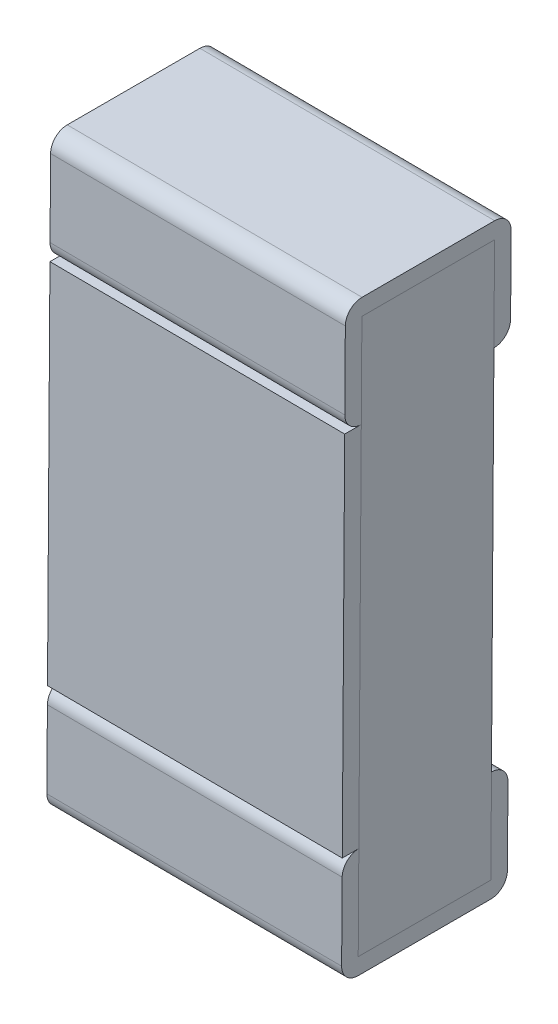
ISO-10303-21;
HEADER;
FILE_DESCRIPTION(('STEP AP214'),'2;1');
FILE_NAME('part.step','',(''),(''),'','','');
FILE_SCHEMA(('AUTOMOTIVE_DESIGN { 1 0 10303 214 1 1 1 1 }'));
ENDSEC;
DATA;
#1=APPLICATION_CONTEXT('core data for automotive mechanical design processes');
#2=APPLICATION_PROTOCOL_DEFINITION('international standard','automotive_design',2000,#1);
#3=PRODUCT_CONTEXT('',#1,'mechanical');
#4=PRODUCT('Part','Part','',(#3));
#5=PRODUCT_RELATED_PRODUCT_CATEGORY('part','',(#4));
#6=PRODUCT_DEFINITION_FORMATION('','',#4);
#7=PRODUCT_DEFINITION_CONTEXT('part definition',#1,'design');
#8=PRODUCT_DEFINITION('design','',#6,#7);
#9=PRODUCT_DEFINITION_SHAPE('','',#8);
#10=(LENGTH_UNIT() NAMED_UNIT(*) SI_UNIT(.MILLI.,.METRE.));
#11=(NAMED_UNIT(*) PLANE_ANGLE_UNIT() SI_UNIT($,.RADIAN.));
#12=(NAMED_UNIT(*) SI_UNIT($,.STERADIAN.) SOLID_ANGLE_UNIT());
#13=UNCERTAINTY_MEASURE_WITH_UNIT(LENGTH_MEASURE(1.E-05),#10,'distance_accuracy_value','');
#14=(GEOMETRIC_REPRESENTATION_CONTEXT(3) GLOBAL_UNCERTAINTY_ASSIGNED_CONTEXT((#13)) GLOBAL_UNIT_ASSIGNED_CONTEXT((#10,
#11,#12)) REPRESENTATION_CONTEXT('',''));
#15=CARTESIAN_POINT('',(0.,0.,0.));
#16=DIRECTION('',(0.,0.,1.));
#17=DIRECTION('',(1.,0.,0.));
#18=AXIS2_PLACEMENT_3D('',#15,#16,#17);
#19=CARTESIAN_POINT('',(214.437616581367,106.274761831493,142.661582908599));
#20=DIRECTION('',(0.,0.,1.));
#21=DIRECTION('',(1.,0.,0.));
#22=AXIS2_PLACEMENT_3D('',#19,#20,#21);
#23=PLANE('',#22);
#24=DIRECTION('',(0.999978016708569,-0.00663069374923689,0.));
#25=VECTOR('',#24,1.);
#26=CARTESIAN_POINT('',(214.437616581367,106.274761831493,142.661582908599));
#27=LINE('',#26,#25);
#28=CARTESIAN_POINT('',(214.437616581367,106.274761831493,142.661582908599));
#29=VERTEX_POINT('',#28);
#30=CARTESIAN_POINT('',(215.237598994734,106.269457276494,142.661582908599));
#31=VERTEX_POINT('',#30);
#32=EDGE_CURVE('E67',#29,#31,#27,.T.);
#33=ORIENTED_EDGE('',*,*,#32,.F.);
#34=DIRECTION('',(-0.00663069374923689,-0.999978016708569,0.));
#35=VECTOR('',#34,1.);
#36=CARTESIAN_POINT('',(214.437616581367,106.274761831493,142.661582908599));
#37=LINE('',#36,#35);
#38=CARTESIAN_POINT('',(214.430985887618,105.274783814784,142.661582908599));
#39=VERTEX_POINT('',#38);
#40=EDGE_CURVE('E11',#29,#39,#37,.T.);
#41=ORIENTED_EDGE('',*,*,#40,.T.);
#42=DIRECTION('',(0.999978016708569,-0.00663069374923689,0.));
#43=VECTOR('',#42,1.);
#44=CARTESIAN_POINT('',(214.430985887618,105.274783814784,142.661582908599));
#45=LINE('',#44,#43);
#46=CARTESIAN_POINT('',(215.230968300984,105.269479259785,142.661582908599));
#47=VERTEX_POINT('',#46);
#48=EDGE_CURVE('E55',#39,#47,#45,.T.);
#49=ORIENTED_EDGE('',*,*,#48,.T.);
#50=DIRECTION('',(-0.00663069374923689,-0.999978016708569,0.));
#51=VECTOR('',#50,1.);
#52=CARTESIAN_POINT('',(215.237598994734,106.269457276494,142.661582908599));
#53=LINE('',#52,#51);
#54=EDGE_CURVE('E345',#31,#47,#53,.T.);
#55=ORIENTED_EDGE('',*,*,#54,.F.);
#56=EDGE_LOOP('',(#33,#41,#49,#55));
#57=FACE_BOUND('',#56,.T.);
#58=ADVANCED_FACE('F44',(#57),#23,.T.);
#59=CARTESIAN_POINT('',(214.430985887618,105.274783814784,142.616582908599));
#60=DIRECTION('',(-0.00663069374923689,-0.99997801670857,0.));
#61=DIRECTION('',(-0.99997801670857,0.00663069374923689,0.));
#62=AXIS2_PLACEMENT_3D('',#59,#60,#61);
#63=PLANE('',#62);
#64=DIRECTION('',(0.,0.,1.));
#65=VECTOR('',#64,1.);
#66=CARTESIAN_POINT('',(214.430985887618,105.274783814784,142.616582908599));
#67=LINE('',#66,#65);
#68=CARTESIAN_POINT('',(214.430985887618,105.274783814784,142.616582908599));
#69=VERTEX_POINT('',#68);
#70=EDGE_CURVE('E377',#69,#39,#67,.T.);
#71=ORIENTED_EDGE('',*,*,#70,.F.);
#72=DIRECTION('',(0.999978016708569,-0.00663069374923689,0.));
#73=VECTOR('',#72,1.);
#74=CARTESIAN_POINT('',(214.430985887618,105.274783814784,142.616582908599));
#75=LINE('',#74,#73);
#76=CARTESIAN_POINT('',(215.230968300984,105.269479259785,142.616582908599));
#77=VERTEX_POINT('',#76);
#78=EDGE_CURVE('E311',#69,#77,#75,.T.);
#79=ORIENTED_EDGE('',*,*,#78,.T.);
#80=DIRECTION('',(0.,0.,1.));
#81=VECTOR('',#80,1.);
#82=CARTESIAN_POINT('',(215.230968300984,105.269479259785,142.616582908599));
#83=LINE('',#82,#81);
#84=EDGE_CURVE('E324',#77,#47,#83,.T.);
#85=ORIENTED_EDGE('',*,*,#84,.T.);
#86=ORIENTED_EDGE('',*,*,#48,.F.);
#87=EDGE_LOOP('',(#71,#79,#85,#86));
#88=FACE_BOUND('',#87,.T.);
#89=ADVANCED_FACE('F443',(#88),#63,.T.);
#90=CARTESIAN_POINT('',(214.430687506399,105.229784804033,142.616582908599));
#91=DIRECTION('',(0.999978016708571,-0.00663069374900344,0.));
#92=DIRECTION('',(0.00663069374900344,0.999978016708571,0.));
#93=AXIS2_PLACEMENT_3D('',#90,#91,#92);
#94=CYLINDRICAL_SURFACE('',#93,0.0450000000000037);
#95=CARTESIAN_POINT('',(214.430687506399,105.229784804033,142.616582908599));
#96=DIRECTION('',(0.99997801670857,-0.00663069374923689,0.));
#97=DIRECTION('',(0.,0.,1.));
#98=AXIS2_PLACEMENT_3D('',#95,#96,#97);
#99=CIRCLE('',#98,0.0449999999999895);
#100=CARTESIAN_POINT('',(214.430687506399,105.229784804033,142.661582908599));
#101=VERTEX_POINT('',#100);
#102=EDGE_CURVE('E321',#69,#101,#99,.T.);
#103=ORIENTED_EDGE('',*,*,#102,.T.);
#104=DIRECTION('',(0.999978016708569,-0.00663069374923689,0.));
#105=VECTOR('',#104,1.);
#106=CARTESIAN_POINT('',(214.430687506399,105.229784804033,142.661582908599));
#107=LINE('',#106,#105);
#108=CARTESIAN_POINT('',(215.230669919766,105.224480249033,142.661582908599));
#109=VERTEX_POINT('',#108);
#110=EDGE_CURVE('E325',#101,#109,#107,.T.);
#111=ORIENTED_EDGE('',*,*,#110,.T.);
#112=CARTESIAN_POINT('',(215.230669919766,105.224480249033,142.616582908599));
#113=DIRECTION('',(0.99997801670857,-0.00663069374923689,0.));
#114=DIRECTION('',(0.,0.,1.));
#115=AXIS2_PLACEMENT_3D('',#112,#113,#114);
#116=CIRCLE('',#115,0.0449999999999895);
#117=EDGE_CURVE('E287',#77,#109,#116,.T.);
#118=ORIENTED_EDGE('',*,*,#117,.F.);
#119=ORIENTED_EDGE('',*,*,#78,.F.);
#120=EDGE_LOOP('',(#103,#111,#118,#119));
#121=FACE_BOUND('',#120,.T.);
#122=ADVANCED_FACE('F575',(#121),#94,.T.);
#123=CARTESIAN_POINT('',(214.430985887618,105.274783814784,142.661582908599));
#124=DIRECTION('',(0.,0.,1.));
#125=DIRECTION('',(1.,0.,0.));
#126=AXIS2_PLACEMENT_3D('',#123,#124,#125);
#127=PLANE('',#126);
#128=DIRECTION('',(-0.00663069374923689,-0.999978016708569,0.));
#129=VECTOR('',#128,1.);
#130=CARTESIAN_POINT('',(215.230968300984,105.269479259785,142.661582908599));
#131=LINE('',#130,#129);
#132=CARTESIAN_POINT('',(215.229277474078,105.014484865524,142.661582908599));
#133=VERTEX_POINT('',#132);
#134=EDGE_CURVE('E291',#109,#133,#131,.T.);
#135=ORIENTED_EDGE('',*,*,#134,.F.);
#136=ORIENTED_EDGE('',*,*,#110,.F.);
#137=DIRECTION('',(-0.00663069374923689,-0.999978016708569,0.));
#138=VECTOR('',#137,1.);
#139=CARTESIAN_POINT('',(214.430985887618,105.274783814784,142.661582908599));
#140=LINE('',#139,#138);
#141=CARTESIAN_POINT('',(214.429295060711,105.019789420524,142.661582908599));
#142=VERTEX_POINT('',#141);
#143=EDGE_CURVE('E331',#101,#142,#140,.T.);
#144=ORIENTED_EDGE('',*,*,#143,.T.);
#145=DIRECTION('',(0.999978016708569,-0.00663069374923689,0.));
#146=VECTOR('',#145,1.);
#147=CARTESIAN_POINT('',(214.429295060711,105.019789420524,142.661582908599));
#148=LINE('',#147,#146);
#149=EDGE_CURVE('E327',#142,#133,#148,.T.);
#150=ORIENTED_EDGE('',*,*,#149,.T.);
#151=EDGE_LOOP('',(#135,#136,#144,#150));
#152=FACE_BOUND('',#151,.T.);
#153=ADVANCED_FACE('F605',(#152),#127,.T.);
#154=CARTESIAN_POINT('',(214.429295060711,105.019789420524,142.616582908599));
#155=DIRECTION('',(0.999978016708571,-0.00663069374900344,0.));
#156=DIRECTION('',(-0.00663069374900344,-0.999978016708571,0.));
#157=AXIS2_PLACEMENT_3D('',#154,#155,#156);
#158=CYLINDRICAL_SURFACE('',#157,0.0450000000000037);
#159=DIRECTION('',(0.999978016708569,-0.00663069374923689,0.));
#160=VECTOR('',#159,1.);
#161=CARTESIAN_POINT('',(214.428996679493,104.974790409772,142.616582908599));
#162=LINE('',#161,#160);
#163=CARTESIAN_POINT('',(214.428996679493,104.974790409772,142.616582908599));
#164=VERTEX_POINT('',#163);
#165=CARTESIAN_POINT('',(215.22897909286,104.969485854773,142.616582908599));
#166=VERTEX_POINT('',#165);
#167=EDGE_CURVE('E275',#164,#166,#162,.T.);
#168=ORIENTED_EDGE('',*,*,#167,.T.);
#169=CARTESIAN_POINT('',(215.229277474078,105.014484865524,142.616582908599));
#170=DIRECTION('',(-0.99997801670857,0.00663069374923689,0.));
#171=DIRECTION('',(0.,0.,1.));
#172=AXIS2_PLACEMENT_3D('',#169,#170,#171);
#173=CIRCLE('',#172,0.0449999999999895);
#174=EDGE_CURVE('E271',#166,#133,#173,.T.);
#175=ORIENTED_EDGE('',*,*,#174,.T.);
#176=ORIENTED_EDGE('',*,*,#149,.F.);
#177=CARTESIAN_POINT('',(214.429295060711,105.019789420524,142.616582908599));
#178=DIRECTION('',(-0.99997801670857,0.00663069374923689,0.));
#179=DIRECTION('',(0.,0.,1.));
#180=AXIS2_PLACEMENT_3D('',#177,#178,#179);
#181=CIRCLE('',#180,0.0449999999999895);
#182=EDGE_CURVE('E264',#164,#142,#181,.T.);
#183=ORIENTED_EDGE('',*,*,#182,.F.);
#184=EDGE_LOOP('',(#168,#175,#176,#183));
#185=FACE_BOUND('',#184,.T.);
#186=ADVANCED_FACE('F594',(#185),#158,.T.);
#187=CARTESIAN_POINT('',(214.428996679493,104.974790409772,142.211582908599));
#188=DIRECTION('',(-0.00663069374923689,-0.99997801670857,0.));
#189=DIRECTION('',(-0.99997801670857,0.00663069374923689,0.));
#190=AXIS2_PLACEMENT_3D('',#187,#188,#189);
#191=PLANE('',#190);
#192=DIRECTION('',(0.,0.,1.));
#193=VECTOR('',#192,1.);
#194=CARTESIAN_POINT('',(214.428996679493,104.974790409772,142.211582908599));
#195=LINE('',#194,#193);
#196=CARTESIAN_POINT('',(214.428996679493,104.974790409772,142.256582908599));
#197=VERTEX_POINT('',#196);
#198=EDGE_CURVE('E259',#197,#164,#195,.T.);
#199=ORIENTED_EDGE('',*,*,#198,.F.);
#200=DIRECTION('',(0.999978016708569,-0.00663069374923689,0.));
#201=VECTOR('',#200,1.);
#202=CARTESIAN_POINT('',(214.428996679493,104.974790409772,142.256582908599));
#203=LINE('',#202,#201);
#204=CARTESIAN_POINT('',(215.22897909286,104.969485854773,142.256582908599));
#205=VERTEX_POINT('',#204);
#206=EDGE_CURVE('E276',#197,#205,#203,.T.);
#207=ORIENTED_EDGE('',*,*,#206,.T.);
#208=DIRECTION('',(0.,0.,1.));
#209=VECTOR('',#208,1.);
#210=CARTESIAN_POINT('',(215.22897909286,104.969485854773,142.211582908599));
#211=LINE('',#210,#209);
#212=EDGE_CURVE('E406',#205,#166,#211,.T.);
#213=ORIENTED_EDGE('',*,*,#212,.T.);
#214=ORIENTED_EDGE('',*,*,#167,.F.);
#215=EDGE_LOOP('',(#199,#207,#213,#214));
#216=FACE_BOUND('',#215,.T.);
#217=ADVANCED_FACE('F478',(#216),#191,.T.);
#218=CARTESIAN_POINT('',(214.429295060711,105.019789420524,142.256582908599));
#219=DIRECTION('',(0.999978016708571,-0.00663069374900344,0.));
#220=DIRECTION('',(-0.00663069374900344,-0.999978016708571,0.));
#221=AXIS2_PLACEMENT_3D('',#218,#219,#220);
#222=CYLINDRICAL_SURFACE('',#221,0.0450000000000037);
#223=CARTESIAN_POINT('',(214.429295060711,105.019789420524,142.256582908599));
#224=DIRECTION('',(0.99997801670857,-0.00663069374923689,0.));
#225=DIRECTION('',(0.,0.,1.));
#226=AXIS2_PLACEMENT_3D('',#223,#224,#225);
#227=CIRCLE('',#226,0.0449999999999895);
#228=CARTESIAN_POINT('',(214.429295060711,105.019789420524,142.211582908599));
#229=VERTEX_POINT('',#228);
#230=EDGE_CURVE('E402',#197,#229,#227,.T.);
#231=ORIENTED_EDGE('',*,*,#230,.T.);
#232=DIRECTION('',(0.999978016708569,-0.00663069374923689,0.));
#233=VECTOR('',#232,1.);
#234=CARTESIAN_POINT('',(214.429295060711,105.019789420524,142.211582908599));
#235=LINE('',#234,#233);
#236=CARTESIAN_POINT('',(215.229277474078,105.014484865524,142.211582908599));
#237=VERTEX_POINT('',#236);
#238=EDGE_CURVE('E407',#229,#237,#235,.T.);
#239=ORIENTED_EDGE('',*,*,#238,.T.);
#240=CARTESIAN_POINT('',(215.229277474078,105.014484865524,142.256582908599));
#241=DIRECTION('',(0.99997801670857,-0.00663069374923689,0.));
#242=DIRECTION('',(0.,0.,1.));
#243=AXIS2_PLACEMENT_3D('',#240,#241,#242);
#244=CIRCLE('',#243,0.0449999999999895);
#245=EDGE_CURVE('E303',#205,#237,#244,.T.);
#246=ORIENTED_EDGE('',*,*,#245,.F.);
#247=ORIENTED_EDGE('',*,*,#206,.F.);
#248=EDGE_LOOP('',(#231,#239,#246,#247));
#249=FACE_BOUND('',#248,.T.);
#250=ADVANCED_FACE('F484',(#249),#222,.T.);
#251=CARTESIAN_POINT('',(214.430985887618,105.274783814784,142.211582908599));
#252=DIRECTION('',(0.,0.,1.));
#253=DIRECTION('',(1.,0.,0.));
#254=AXIS2_PLACEMENT_3D('',#251,#252,#253);
#255=PLANE('',#254);
#256=ORIENTED_EDGE('',*,*,#238,.F.);
#257=DIRECTION('',(-0.00663069374923689,-0.999978016708569,0.));
#258=VECTOR('',#257,1.);
#259=CARTESIAN_POINT('',(214.430985887618,105.274783814784,142.211582908599));
#260=LINE('',#259,#258);
#261=CARTESIAN_POINT('',(214.430687506399,105.229784804033,142.211582908599));
#262=VERTEX_POINT('',#261);
#263=EDGE_CURVE('E282',#262,#229,#260,.T.);
#264=ORIENTED_EDGE('',*,*,#263,.F.);
#265=DIRECTION('',(0.999978016708569,-0.00663069374923689,0.));
#266=VECTOR('',#265,1.);
#267=CARTESIAN_POINT('',(214.430687506399,105.229784804033,142.211582908599));
#268=LINE('',#267,#266);
#269=CARTESIAN_POINT('',(215.230669919766,105.224480249033,142.211582908599));
#270=VERTEX_POINT('',#269);
#271=EDGE_CURVE('E388',#262,#270,#268,.T.);
#272=ORIENTED_EDGE('',*,*,#271,.T.);
#273=DIRECTION('',(-0.00663069374923689,-0.999978016708569,0.));
#274=VECTOR('',#273,1.);
#275=CARTESIAN_POINT('',(215.230968300984,105.269479259785,142.211582908599));
#276=LINE('',#275,#274);
#277=EDGE_CURVE('E269',#270,#237,#276,.T.);
#278=ORIENTED_EDGE('',*,*,#277,.T.);
#279=EDGE_LOOP('',(#256,#264,#272,#278));
#280=FACE_BOUND('',#279,.T.);
#281=ADVANCED_FACE('F46',(#280),#255,.F.);
#282=CARTESIAN_POINT('',(214.430687506399,105.229784804033,142.256582908599));
#283=DIRECTION('',(0.999978016708571,-0.00663069374900344,0.));
#284=DIRECTION('',(0.00663069374900344,0.999978016708571,0.));
#285=AXIS2_PLACEMENT_3D('',#282,#283,#284);
#286=CYLINDRICAL_SURFACE('',#285,0.0450000000000037);
#287=DIRECTION('',(0.999978016708569,-0.00663069374923689,0.));
#288=VECTOR('',#287,1.);
#289=CARTESIAN_POINT('',(214.430985887618,105.274783814784,142.256582908599));
#290=LINE('',#289,#288);
#291=CARTESIAN_POINT('',(214.430985887618,105.274783814784,142.256582908599));
#292=VERTEX_POINT('',#291);
#293=CARTESIAN_POINT('',(215.230968300984,105.269479259785,142.256582908599));
#294=VERTEX_POINT('',#293);
#295=EDGE_CURVE('E265',#292,#294,#290,.T.);
#296=ORIENTED_EDGE('',*,*,#295,.T.);
#297=CARTESIAN_POINT('',(215.230669919766,105.224480249033,142.256582908599));
#298=DIRECTION('',(-0.99997801670857,0.00663069374923689,0.));
#299=DIRECTION('',(0.,0.,1.));
#300=AXIS2_PLACEMENT_3D('',#297,#298,#299);
#301=CIRCLE('',#300,0.0449999999999895);
#302=EDGE_CURVE('E270',#294,#270,#301,.T.);
#303=ORIENTED_EDGE('',*,*,#302,.T.);
#304=ORIENTED_EDGE('',*,*,#271,.F.);
#305=CARTESIAN_POINT('',(214.430687506399,105.229784804033,142.256582908599));
#306=DIRECTION('',(-0.99997801670857,0.00663069374923689,0.));
#307=DIRECTION('',(0.,0.,1.));
#308=AXIS2_PLACEMENT_3D('',#305,#306,#307);
#309=CIRCLE('',#308,0.0449999999999895);
#310=EDGE_CURVE('E277',#292,#262,#309,.T.);
#311=ORIENTED_EDGE('',*,*,#310,.F.);
#312=EDGE_LOOP('',(#296,#303,#304,#311));
#313=FACE_BOUND('',#312,.T.);
#314=ADVANCED_FACE('F496',(#313),#286,.T.);
#315=CARTESIAN_POINT('',(215.237598994734,106.269457276494,142.616582908599));
#316=DIRECTION('',(0.99997801670857,-0.00663069374923689,0.));
#317=DIRECTION('',(0.,0.,-1.));
#318=AXIS2_PLACEMENT_3D('',#315,#316,#317);
#319=PLANE('',#318);
#320=DIRECTION('',(-0.00663069374923689,-0.999978016708569,0.));
#321=VECTOR('',#320,1.);
#322=CARTESIAN_POINT('',(215.237598994734,106.269457276494,142.616582908599));
#323=LINE('',#322,#321);
#324=CARTESIAN_POINT('',(215.237598994734,106.269457276494,142.616582908599));
#325=VERTEX_POINT('',#324);
#326=EDGE_CURVE('E341',#325,#77,#323,.T.);
#327=ORIENTED_EDGE('',*,*,#326,.F.);
#328=DIRECTION('',(0.,0.,1.));
#329=VECTOR('',#328,1.);
#330=CARTESIAN_POINT('',(215.237598994734,106.269457276494,142.616582908599));
#331=LINE('',#330,#329);
#332=EDGE_CURVE('E342',#325,#31,#331,.T.);
#333=ORIENTED_EDGE('',*,*,#332,.T.);
#334=ORIENTED_EDGE('',*,*,#54,.T.);
#335=ORIENTED_EDGE('',*,*,#84,.F.);
#336=EDGE_LOOP('',(#327,#333,#334,#335));
#337=FACE_BOUND('',#336,.T.);
#338=ADVANCED_FACE('F447',(#337),#319,.T.);
#339=CARTESIAN_POINT('',(215.230968300984,105.269479259785,142.211582908599));
#340=DIRECTION('',(0.99997801670857,-0.00663069374923689,0.));
#341=DIRECTION('',(0.,0.,-1.));
#342=AXIS2_PLACEMENT_3D('',#339,#340,#341);
#343=PLANE('',#342);
#344=ORIENTED_EDGE('',*,*,#277,.F.);
#345=ORIENTED_EDGE('',*,*,#302,.F.);
#346=DIRECTION('',(-0.00663069374923689,-0.999978016708569,0.));
#347=VECTOR('',#346,1.);
#348=CARTESIAN_POINT('',(215.23928982164,106.524451670754,142.256582908599));
#349=LINE('',#348,#347);
#350=CARTESIAN_POINT('',(215.229277474078,105.014484865524,142.256582908599));
#351=VERTEX_POINT('',#350);
#352=EDGE_CURVE('E349',#294,#351,#349,.T.);
#353=ORIENTED_EDGE('',*,*,#352,.T.);
#354=DIRECTION('',(0.,0.,1.));
#355=VECTOR('',#354,1.);
#356=CARTESIAN_POINT('',(215.229277474078,105.014484865524,142.256582908599));
#357=LINE('',#356,#355);
#358=CARTESIAN_POINT('',(215.229277474078,105.014484865524,142.616582908599));
#359=VERTEX_POINT('',#358);
#360=EDGE_CURVE('E290',#351,#359,#357,.T.);
#361=ORIENTED_EDGE('',*,*,#360,.T.);
#362=DIRECTION('',(-0.00663069374923689,-0.999978016708569,0.));
#363=VECTOR('',#362,1.);
#364=CARTESIAN_POINT('',(215.23928982164,106.524451670754,142.616582908599));
#365=LINE('',#364,#363);
#366=EDGE_CURVE('E300',#77,#359,#365,.T.);
#367=ORIENTED_EDGE('',*,*,#366,.F.);
#368=ORIENTED_EDGE('',*,*,#117,.T.);
#369=ORIENTED_EDGE('',*,*,#134,.T.);
#370=ORIENTED_EDGE('',*,*,#174,.F.);
#371=ORIENTED_EDGE('',*,*,#212,.F.);
#372=ORIENTED_EDGE('',*,*,#245,.T.);
#373=EDGE_LOOP('',(#344,#345,#353,#361,#367,#368,#369,#370,#371,#372));
#374=FACE_BOUND('',#373,.T.);
#375=ADVANCED_FACE('F584',(#374),#343,.T.);
#376=CARTESIAN_POINT('',(214.437616581367,106.274761831493,142.616582908599));
#377=DIRECTION('',(-0.00663069374923689,-0.99997801670857,0.));
#378=DIRECTION('',(-0.99997801670857,0.00663069374923689,0.));
#379=AXIS2_PLACEMENT_3D('',#376,#377,#378);
#380=PLANE('',#379);
#381=ORIENTED_EDGE('',*,*,#32,.T.);
#382=ORIENTED_EDGE('',*,*,#332,.F.);
#383=DIRECTION('',(0.999978016708569,-0.00663069374923689,0.));
#384=VECTOR('',#383,1.);
#385=CARTESIAN_POINT('',(214.437616581367,106.274761831493,142.616582908599));
#386=LINE('',#385,#384);
#387=CARTESIAN_POINT('',(214.437616581367,106.274761831493,142.616582908599));
#388=VERTEX_POINT('',#387);
#389=EDGE_CURVE('E296',#388,#325,#386,.T.);
#390=ORIENTED_EDGE('',*,*,#389,.F.);
#391=DIRECTION('',(0.,0.,1.));
#392=VECTOR('',#391,1.);
#393=CARTESIAN_POINT('',(214.437616581367,106.274761831493,142.616582908599));
#394=LINE('',#393,#392);
#395=EDGE_CURVE('E304',#388,#29,#394,.T.);
#396=ORIENTED_EDGE('',*,*,#395,.T.);
#397=EDGE_LOOP('',(#381,#382,#390,#396));
#398=FACE_BOUND('',#397,.T.);
#399=ADVANCED_FACE('F565',(#398),#380,.F.);
#400=CARTESIAN_POINT('',(214.437616581367,106.274761831493,142.616582908599));
#401=DIRECTION('',(0.99997801670857,-0.00663069374923689,0.));
#402=DIRECTION('',(0.,0.,-1.));
#403=AXIS2_PLACEMENT_3D('',#400,#401,#402);
#404=PLANE('',#403);
#405=ORIENTED_EDGE('',*,*,#70,.T.);
#406=ORIENTED_EDGE('',*,*,#40,.F.);
#407=ORIENTED_EDGE('',*,*,#395,.F.);
#408=DIRECTION('',(-0.00663069374923689,-0.999978016708569,0.));
#409=VECTOR('',#408,1.);
#410=CARTESIAN_POINT('',(214.437616581367,106.274761831493,142.616582908599));
#411=LINE('',#410,#409);
#412=EDGE_CURVE('E263',#388,#69,#411,.T.);
#413=ORIENTED_EDGE('',*,*,#412,.T.);
#414=EDGE_LOOP('',(#405,#406,#407,#413));
#415=FACE_BOUND('',#414,.T.);
#416=ADVANCED_FACE('F569',(#415),#404,.F.);
#417=CARTESIAN_POINT('',(214.430985887618,105.274783814784,142.211582908599));
#418=DIRECTION('',(0.99997801670857,-0.00663069374923689,0.));
#419=DIRECTION('',(0.,0.,-1.));
#420=AXIS2_PLACEMENT_3D('',#417,#418,#419);
#421=PLANE('',#420);
#422=ORIENTED_EDGE('',*,*,#230,.F.);
#423=ORIENTED_EDGE('',*,*,#198,.T.);
#424=ORIENTED_EDGE('',*,*,#182,.T.);
#425=ORIENTED_EDGE('',*,*,#143,.F.);
#426=ORIENTED_EDGE('',*,*,#102,.F.);
#427=DIRECTION('',(-0.00663069374923689,-0.999978016708569,0.));
#428=VECTOR('',#427,1.);
#429=CARTESIAN_POINT('',(214.439307408273,106.529756225754,142.616582908599));
#430=LINE('',#429,#428);
#431=CARTESIAN_POINT('',(214.429295060711,105.019789420524,142.616582908599));
#432=VERTEX_POINT('',#431);
#433=EDGE_CURVE('E281',#69,#432,#430,.T.);
#434=ORIENTED_EDGE('',*,*,#433,.T.);
#435=DIRECTION('',(0.,0.,1.));
#436=VECTOR('',#435,1.);
#437=CARTESIAN_POINT('',(214.429295060711,105.019789420524,142.256582908599));
#438=LINE('',#437,#436);
#439=CARTESIAN_POINT('',(214.429295060711,105.019789420524,142.256582908599));
#440=VERTEX_POINT('',#439);
#441=EDGE_CURVE('E312',#440,#432,#438,.T.);
#442=ORIENTED_EDGE('',*,*,#441,.F.);
#443=DIRECTION('',(-0.00663069374923689,-0.999978016708569,0.));
#444=VECTOR('',#443,1.);
#445=CARTESIAN_POINT('',(214.439307408273,106.529756225754,142.256582908599));
#446=LINE('',#445,#444);
#447=EDGE_CURVE('E316',#292,#440,#446,.T.);
#448=ORIENTED_EDGE('',*,*,#447,.F.);
#449=ORIENTED_EDGE('',*,*,#310,.T.);
#450=ORIENTED_EDGE('',*,*,#263,.T.);
#451=EDGE_LOOP('',(#422,#423,#424,#425,#426,#434,#442,#448,#449,#450));
#452=FACE_BOUND('',#451,.T.);
#453=ADVANCED_FACE('F489',(#452),#421,.F.);
#454=CARTESIAN_POINT('',(214.439307408273,106.529756225754,142.256582908599));
#455=DIRECTION('',(0.,0.,1.));
#456=DIRECTION('',(1.,0.,0.));
#457=AXIS2_PLACEMENT_3D('',#454,#455,#456);
#458=PLANE('',#457);
#459=DIRECTION('',(-0.00663069374923689,-0.999978016708569,0.));
#460=VECTOR('',#459,1.);
#461=CARTESIAN_POINT('',(215.23928982164,106.524451670754,142.256582908599));
#462=LINE('',#461,#460);
#463=CARTESIAN_POINT('',(215.237598994734,106.269457276494,142.256582908599));
#464=VERTEX_POINT('',#463);
#465=EDGE_CURVE('E353',#464,#294,#462,.T.);
#466=ORIENTED_EDGE('',*,*,#465,.T.);
#467=ORIENTED_EDGE('',*,*,#295,.F.);
#468=DIRECTION('',(-0.00663069374923689,-0.999978016708569,0.));
#469=VECTOR('',#468,1.);
#470=CARTESIAN_POINT('',(214.439307408273,106.529756225754,142.256582908599));
#471=LINE('',#470,#469);
#472=CARTESIAN_POINT('',(214.437616581367,106.274761831493,142.256582908599));
#473=VERTEX_POINT('',#472);
#474=EDGE_CURVE('E381',#473,#292,#471,.T.);
#475=ORIENTED_EDGE('',*,*,#474,.F.);
#476=DIRECTION('',(0.999978016708569,-0.00663069374923689,0.));
#477=VECTOR('',#476,1.);
#478=CARTESIAN_POINT('',(214.437616581367,106.274761831493,142.256582908599));
#479=LINE('',#478,#477);
#480=EDGE_CURVE('E357',#473,#464,#479,.T.);
#481=ORIENTED_EDGE('',*,*,#480,.T.);
#482=EDGE_LOOP('',(#466,#467,#475,#481));
#483=FACE_BOUND('',#482,.T.);
#484=ADVANCED_FACE('F539',(#483),#458,.F.);
#485=CARTESIAN_POINT('',(215.23928982164,106.524451670754,142.256582908599));
#486=DIRECTION('',(0.99997801670857,-0.00663069374923689,0.));
#487=DIRECTION('',(0.,0.,-1.));
#488=AXIS2_PLACEMENT_3D('',#485,#486,#487);
#489=PLANE('',#488);
#490=DIRECTION('',(-0.00663069374923689,-0.999978016708569,0.));
#491=VECTOR('',#490,1.);
#492=CARTESIAN_POINT('',(215.23928982164,106.524451670754,142.256582908599));
#493=LINE('',#492,#491);
#494=CARTESIAN_POINT('',(215.23928982164,106.524451670754,142.256582908599));
#495=VERTEX_POINT('',#494);
#496=EDGE_CURVE('E257',#495,#464,#493,.T.);
#497=ORIENTED_EDGE('',*,*,#496,.F.);
#498=DIRECTION('',(0.,0.,1.));
#499=VECTOR('',#498,1.);
#500=CARTESIAN_POINT('',(215.23928982164,106.524451670754,142.256582908599));
#501=LINE('',#500,#499);
#502=CARTESIAN_POINT('',(215.23928982164,106.524451670754,142.616582908599));
#503=VERTEX_POINT('',#502);
#504=EDGE_CURVE('E354',#495,#503,#501,.T.);
#505=ORIENTED_EDGE('',*,*,#504,.T.);
#506=DIRECTION('',(-0.00663069374923689,-0.999978016708569,0.));
#507=VECTOR('',#506,1.);
#508=CARTESIAN_POINT('',(215.23928982164,106.524451670754,142.616582908599));
#509=LINE('',#508,#507);
#510=EDGE_CURVE('E358',#503,#325,#509,.T.);
#511=ORIENTED_EDGE('',*,*,#510,.T.);
#512=ORIENTED_EDGE('',*,*,#326,.T.);
#513=ORIENTED_EDGE('',*,*,#366,.T.);
#514=ORIENTED_EDGE('',*,*,#360,.F.);
#515=ORIENTED_EDGE('',*,*,#352,.F.);
#516=ORIENTED_EDGE('',*,*,#465,.F.);
#517=EDGE_LOOP('',(#497,#505,#511,#512,#513,#514,#515,#516));
#518=FACE_BOUND('',#517,.T.);
#519=ADVANCED_FACE('F599',(#518),#489,.T.);
#520=CARTESIAN_POINT('',(214.437914962585,106.319760842245,142.616582908599));
#521=DIRECTION('',(0.999978016708571,-0.00663069374900344,0.));
#522=DIRECTION('',(-0.00663069374900344,-0.999978016708571,0.));
#523=AXIS2_PLACEMENT_3D('',#520,#521,#522);
#524=CYLINDRICAL_SURFACE('',#523,0.0450000000000037);
#525=ORIENTED_EDGE('',*,*,#389,.T.);
#526=CARTESIAN_POINT('',(215.237897375953,106.314456287246,142.616582908599));
#527=DIRECTION('',(-0.99997801670857,0.00663069374923689,0.));
#528=DIRECTION('',(0.,0.,1.));
#529=AXIS2_PLACEMENT_3D('',#526,#527,#528);
#530=CIRCLE('',#529,0.0449999999999895);
#531=CARTESIAN_POINT('',(215.237897375953,106.314456287246,142.661582908599));
#532=VERTEX_POINT('',#531);
#533=EDGE_CURVE('E292',#325,#532,#530,.T.);
#534=ORIENTED_EDGE('',*,*,#533,.T.);
#535=DIRECTION('',(0.999978016708569,-0.00663069374923689,0.));
#536=VECTOR('',#535,1.);
#537=CARTESIAN_POINT('',(214.437914962585,106.319760842245,142.661582908599));
#538=LINE('',#537,#536);
#539=CARTESIAN_POINT('',(214.437914962585,106.319760842245,142.661582908599));
#540=VERTEX_POINT('',#539);
#541=EDGE_CURVE('E392',#540,#532,#538,.T.);
#542=ORIENTED_EDGE('',*,*,#541,.F.);
#543=CARTESIAN_POINT('',(214.437914962585,106.319760842245,142.616582908599));
#544=DIRECTION('',(-0.99997801670857,0.00663069374923689,0.));
#545=DIRECTION('',(0.,0.,1.));
#546=AXIS2_PLACEMENT_3D('',#543,#544,#545);
#547=CIRCLE('',#546,0.0449999999999895);
#548=EDGE_CURVE('E286',#388,#540,#547,.T.);
#549=ORIENTED_EDGE('',*,*,#548,.F.);
#550=EDGE_LOOP('',(#525,#534,#542,#549));
#551=FACE_BOUND('',#550,.T.);
#552=ADVANCED_FACE('F561',(#551),#524,.T.);
#553=CARTESIAN_POINT('',(214.439605789492,106.574755236506,142.661582908599));
#554=DIRECTION('',(0.,0.,1.));
#555=DIRECTION('',(1.,0.,0.));
#556=AXIS2_PLACEMENT_3D('',#553,#554,#555);
#557=PLANE('',#556);
#558=DIRECTION('',(-0.00663069374923689,-0.999978016708569,0.));
#559=VECTOR('',#558,1.);
#560=CARTESIAN_POINT('',(215.239588202859,106.569450681506,142.661582908599));
#561=LINE('',#560,#559);
#562=CARTESIAN_POINT('',(215.23928982164,106.524451670754,142.661582908599));
#563=VERTEX_POINT('',#562);
#564=EDGE_CURVE('E362',#563,#532,#561,.T.);
#565=ORIENTED_EDGE('',*,*,#564,.F.);
#566=DIRECTION('',(0.999978016708569,-0.00663069374923689,0.));
#567=VECTOR('',#566,1.);
#568=CARTESIAN_POINT('',(214.439307408273,106.529756225754,142.661582908599));
#569=LINE('',#568,#567);
#570=CARTESIAN_POINT('',(214.439307408273,106.529756225754,142.661582908599));
#571=VERTEX_POINT('',#570);
#572=EDGE_CURVE('E243',#571,#563,#569,.T.);
#573=ORIENTED_EDGE('',*,*,#572,.F.);
#574=DIRECTION('',(-0.00663069374923689,-0.999978016708569,0.));
#575=VECTOR('',#574,1.);
#576=CARTESIAN_POINT('',(214.439605789492,106.574755236506,142.661582908599));
#577=LINE('',#576,#575);
#578=EDGE_CURVE('E297',#571,#540,#577,.T.);
#579=ORIENTED_EDGE('',*,*,#578,.T.);
#580=ORIENTED_EDGE('',*,*,#541,.T.);
#581=EDGE_LOOP('',(#565,#573,#579,#580));
#582=FACE_BOUND('',#581,.T.);
#583=ADVANCED_FACE('F556',(#582),#557,.T.);
#584=CARTESIAN_POINT('',(214.439307408273,106.529756225754,142.256582908599));
#585=DIRECTION('',(0.99997801670857,-0.00663069374923689,0.));
#586=DIRECTION('',(0.,0.,-1.));
#587=AXIS2_PLACEMENT_3D('',#584,#585,#586);
#588=PLANE('',#587);
#589=ORIENTED_EDGE('',*,*,#474,.T.);
#590=ORIENTED_EDGE('',*,*,#447,.T.);
#591=ORIENTED_EDGE('',*,*,#441,.T.);
#592=ORIENTED_EDGE('',*,*,#433,.F.);
#593=ORIENTED_EDGE('',*,*,#412,.F.);
#594=DIRECTION('',(-0.00663069374923689,-0.999978016708569,0.));
#595=VECTOR('',#594,1.);
#596=CARTESIAN_POINT('',(214.439307408273,106.529756225754,142.616582908599));
#597=LINE('',#596,#595);
#598=CARTESIAN_POINT('',(214.439307408273,106.529756225754,142.616582908599));
#599=VERTEX_POINT('',#598);
#600=EDGE_CURVE('E247',#599,#388,#597,.T.);
#601=ORIENTED_EDGE('',*,*,#600,.F.);
#602=DIRECTION('',(0.,0.,1.));
#603=VECTOR('',#602,1.);
#604=CARTESIAN_POINT('',(214.439307408273,106.529756225754,142.256582908599));
#605=LINE('',#604,#603);
#606=CARTESIAN_POINT('',(214.439307408273,106.529756225754,142.256582908599));
#607=VERTEX_POINT('',#606);
#608=EDGE_CURVE('E237',#607,#599,#605,.T.);
#609=ORIENTED_EDGE('',*,*,#608,.F.);
#610=DIRECTION('',(-0.00663069374923689,-0.999978016708569,0.));
#611=VECTOR('',#610,1.);
#612=CARTESIAN_POINT('',(214.439307408273,106.529756225754,142.256582908599));
#613=LINE('',#612,#611);
#614=EDGE_CURVE('E317',#607,#473,#613,.T.);
#615=ORIENTED_EDGE('',*,*,#614,.T.);
#616=EDGE_LOOP('',(#589,#590,#591,#592,#593,#601,#609,#615));
#617=FACE_BOUND('',#616,.T.);
#618=ADVANCED_FACE('F534',(#617),#588,.F.);
#619=CARTESIAN_POINT('',(214.437914962585,106.319760842245,142.256582908599));
#620=DIRECTION('',(0.999978016708571,-0.00663069374900344,0.));
#621=DIRECTION('',(-0.00663069374900344,-0.999978016708571,0.));
#622=AXIS2_PLACEMENT_3D('',#619,#620,#621);
#623=CYLINDRICAL_SURFACE('',#622,0.0450000000000037);
#624=CARTESIAN_POINT('',(214.437914962585,106.319760842245,142.256582908599));
#625=DIRECTION('',(0.99997801670857,-0.00663069374923689,0.));
#626=DIRECTION('',(0.,0.,1.));
#627=AXIS2_PLACEMENT_3D('',#624,#625,#626);
#628=CIRCLE('',#627,0.0449999999999895);
#629=CARTESIAN_POINT('',(214.437914962585,106.319760842245,142.211582908599));
#630=VERTEX_POINT('',#629);
#631=EDGE_CURVE('E397',#473,#630,#628,.T.);
#632=ORIENTED_EDGE('',*,*,#631,.T.);
#633=DIRECTION('',(0.999978016708569,-0.00663069374923689,0.));
#634=VECTOR('',#633,1.);
#635=CARTESIAN_POINT('',(214.437914962585,106.319760842245,142.211582908599));
#636=LINE('',#635,#634);
#637=CARTESIAN_POINT('',(215.237897375953,106.314456287246,142.211582908599));
#638=VERTEX_POINT('',#637);
#639=EDGE_CURVE('E209',#630,#638,#636,.T.);
#640=ORIENTED_EDGE('',*,*,#639,.T.);
#641=CARTESIAN_POINT('',(215.237897375953,106.314456287246,142.256582908599));
#642=DIRECTION('',(0.99997801670857,-0.00663069374923689,0.));
#643=DIRECTION('',(0.,0.,1.));
#644=AXIS2_PLACEMENT_3D('',#641,#642,#643);
#645=CIRCLE('',#644,0.0449999999999895);
#646=EDGE_CURVE('E199',#464,#638,#645,.T.);
#647=ORIENTED_EDGE('',*,*,#646,.F.);
#648=ORIENTED_EDGE('',*,*,#480,.F.);
#649=EDGE_LOOP('',(#632,#640,#647,#648));
#650=FACE_BOUND('',#649,.T.);
#651=ADVANCED_FACE('F542',(#650),#623,.T.);
#652=CARTESIAN_POINT('',(214.439605789492,106.574755236506,142.211582908599));
#653=DIRECTION('',(0.,0.,1.));
#654=DIRECTION('',(1.,0.,0.));
#655=AXIS2_PLACEMENT_3D('',#652,#653,#654);
#656=PLANE('',#655);
#657=ORIENTED_EDGE('',*,*,#639,.F.);
#658=DIRECTION('',(-0.00663069374923689,-0.999978016708569,0.));
#659=VECTOR('',#658,1.);
#660=CARTESIAN_POINT('',(214.439605789492,106.574755236506,142.211582908599));
#661=LINE('',#660,#659);
#662=CARTESIAN_POINT('',(214.439307408273,106.529756225754,142.211582908599));
#663=VERTEX_POINT('',#662);
#664=EDGE_CURVE('E228',#663,#630,#661,.T.);
#665=ORIENTED_EDGE('',*,*,#664,.F.);
#666=DIRECTION('',(0.999978016708569,-0.00663069374923689,0.));
#667=VECTOR('',#666,1.);
#668=CARTESIAN_POINT('',(214.439307408273,106.529756225754,142.211582908599));
#669=LINE('',#668,#667);
#670=CARTESIAN_POINT('',(215.23928982164,106.524451670754,142.211582908599));
#671=VERTEX_POINT('',#670);
#672=EDGE_CURVE('E48',#663,#671,#669,.T.);
#673=ORIENTED_EDGE('',*,*,#672,.T.);
#674=DIRECTION('',(-0.00663069374923689,-0.999978016708569,0.));
#675=VECTOR('',#674,1.);
#676=CARTESIAN_POINT('',(215.239588202859,106.569450681506,142.211582908599));
#677=LINE('',#676,#675);
#678=EDGE_CURVE('E215',#671,#638,#677,.T.);
#679=ORIENTED_EDGE('',*,*,#678,.T.);
#680=EDGE_LOOP('',(#657,#665,#673,#679));
#681=FACE_BOUND('',#680,.T.);
#682=ADVANCED_FACE('F226',(#681),#656,.F.);
#683=CARTESIAN_POINT('',(215.239588202859,106.569450681506,142.211582908599));
#684=DIRECTION('',(0.99997801670857,-0.00663069374923689,0.));
#685=DIRECTION('',(0.,0.,-1.));
#686=AXIS2_PLACEMENT_3D('',#683,#684,#685);
#687=PLANE('',#686);
#688=ORIENTED_EDGE('',*,*,#678,.F.);
#689=CARTESIAN_POINT('',(215.23928982164,106.524451670754,142.256582908599));
#690=DIRECTION('',(-0.99997801670857,0.00663069374923689,0.));
#691=DIRECTION('',(0.,0.,1.));
#692=AXIS2_PLACEMENT_3D('',#689,#690,#691);
#693=CIRCLE('',#692,0.0449999999999895);
#694=CARTESIAN_POINT('',(215.239588202859,106.569450681506,142.256582908599));
#695=VERTEX_POINT('',#694);
#696=EDGE_CURVE('E220',#695,#671,#693,.T.);
#697=ORIENTED_EDGE('',*,*,#696,.F.);
#698=DIRECTION('',(0.,0.,1.));
#699=VECTOR('',#698,1.);
#700=CARTESIAN_POINT('',(215.239588202859,106.569450681506,142.211582908599));
#701=LINE('',#700,#699);
#702=CARTESIAN_POINT('',(215.239588202859,106.569450681506,142.616582908599));
#703=VERTEX_POINT('',#702);
#704=EDGE_CURVE('E223',#695,#703,#701,.T.);
#705=ORIENTED_EDGE('',*,*,#704,.T.);
#706=CARTESIAN_POINT('',(215.23928982164,106.524451670754,142.616582908599));
#707=DIRECTION('',(0.99997801670857,-0.00663069374923689,0.));
#708=DIRECTION('',(0.,0.,1.));
#709=AXIS2_PLACEMENT_3D('',#706,#707,#708);
#710=CIRCLE('',#709,0.0449999999999895);
#711=EDGE_CURVE('E254',#703,#563,#710,.T.);
#712=ORIENTED_EDGE('',*,*,#711,.T.);
#713=ORIENTED_EDGE('',*,*,#564,.T.);
#714=ORIENTED_EDGE('',*,*,#533,.F.);
#715=ORIENTED_EDGE('',*,*,#510,.F.);
#716=ORIENTED_EDGE('',*,*,#504,.F.);
#717=ORIENTED_EDGE('',*,*,#496,.T.);
#718=ORIENTED_EDGE('',*,*,#646,.T.);
#719=EDGE_LOOP('',(#688,#697,#705,#712,#713,#714,#715,#716,#717,#718));
#720=FACE_BOUND('',#719,.T.);
#721=ADVANCED_FACE('F217',(#720),#687,.T.);
#722=CARTESIAN_POINT('',(214.439307408273,106.529756225754,142.616582908599));
#723=DIRECTION('',(0.999978016708571,-0.00663069374900344,0.));
#724=DIRECTION('',(0.00663069374900344,0.999978016708571,0.));
#725=AXIS2_PLACEMENT_3D('',#722,#723,#724);
#726=CYLINDRICAL_SURFACE('',#725,0.0450000000000037);
#727=CARTESIAN_POINT('',(214.439307408273,106.529756225754,142.616582908599));
#728=DIRECTION('',(0.99997801670857,-0.00663069374923689,0.));
#729=DIRECTION('',(0.,0.,1.));
#730=AXIS2_PLACEMENT_3D('',#727,#728,#729);
#731=CIRCLE('',#730,0.0449999999999895);
#732=CARTESIAN_POINT('',(214.439605789492,106.574755236506,142.616582908599));
#733=VERTEX_POINT('',#732);
#734=EDGE_CURVE('E258',#733,#571,#731,.T.);
#735=ORIENTED_EDGE('',*,*,#734,.T.);
#736=ORIENTED_EDGE('',*,*,#572,.T.);
#737=ORIENTED_EDGE('',*,*,#711,.F.);
#738=DIRECTION('',(0.999978016708569,-0.00663069374923689,0.));
#739=VECTOR('',#738,1.);
#740=CARTESIAN_POINT('',(214.439605789492,106.574755236506,142.616582908599));
#741=LINE('',#740,#739);
#742=EDGE_CURVE('E366',#733,#703,#741,.T.);
#743=ORIENTED_EDGE('',*,*,#742,.F.);
#744=EDGE_LOOP('',(#735,#736,#737,#743));
#745=FACE_BOUND('',#744,.T.);
#746=ADVANCED_FACE('F552',(#745),#726,.T.);
#747=CARTESIAN_POINT('',(214.439307408273,106.529756225754,142.256582908599));
#748=DIRECTION('',(0.999978016708571,-0.00663069374900344,0.));
#749=DIRECTION('',(0.00663069374900344,0.999978016708571,0.));
#750=AXIS2_PLACEMENT_3D('',#747,#748,#749);
#751=CYLINDRICAL_SURFACE('',#750,0.0450000000000037);
#752=DIRECTION('',(0.999978016708569,-0.00663069374923689,0.));
#753=VECTOR('',#752,1.);
#754=CARTESIAN_POINT('',(214.439605789492,106.574755236506,142.256582908599));
#755=LINE('',#754,#753);
#756=CARTESIAN_POINT('',(214.439605789492,106.574755236506,142.256582908599));
#757=VERTEX_POINT('',#756);
#758=EDGE_CURVE('E235',#757,#695,#755,.T.);
#759=ORIENTED_EDGE('',*,*,#758,.T.);
#760=ORIENTED_EDGE('',*,*,#696,.T.);
#761=ORIENTED_EDGE('',*,*,#672,.F.);
#762=CARTESIAN_POINT('',(214.439307408273,106.529756225754,142.256582908599));
#763=DIRECTION('',(-0.99997801670857,0.00663069374923689,0.));
#764=DIRECTION('',(0.,0.,1.));
#765=AXIS2_PLACEMENT_3D('',#762,#763,#764);
#766=CIRCLE('',#765,0.0449999999999895);
#767=EDGE_CURVE('E251',#757,#663,#766,.T.);
#768=ORIENTED_EDGE('',*,*,#767,.F.);
#769=EDGE_LOOP('',(#759,#760,#761,#768));
#770=FACE_BOUND('',#769,.T.);
#771=ADVANCED_FACE('F233',(#770),#751,.T.);
#772=CARTESIAN_POINT('',(214.439605789492,106.574755236506,142.211582908599));
#773=DIRECTION('',(0.99997801670857,-0.00663069374923689,0.));
#774=DIRECTION('',(0.,0.,-1.));
#775=AXIS2_PLACEMENT_3D('',#772,#773,#774);
#776=PLANE('',#775);
#777=ORIENTED_EDGE('',*,*,#631,.F.);
#778=ORIENTED_EDGE('',*,*,#614,.F.);
#779=ORIENTED_EDGE('',*,*,#608,.T.);
#780=ORIENTED_EDGE('',*,*,#600,.T.);
#781=ORIENTED_EDGE('',*,*,#548,.T.);
#782=ORIENTED_EDGE('',*,*,#578,.F.);
#783=ORIENTED_EDGE('',*,*,#734,.F.);
#784=DIRECTION('',(0.,0.,1.));
#785=VECTOR('',#784,1.);
#786=CARTESIAN_POINT('',(214.439605789492,106.574755236506,142.211582908599));
#787=LINE('',#786,#785);
#788=EDGE_CURVE('E370',#757,#733,#787,.T.);
#789=ORIENTED_EDGE('',*,*,#788,.F.);
#790=ORIENTED_EDGE('',*,*,#767,.T.);
#791=ORIENTED_EDGE('',*,*,#664,.T.);
#792=EDGE_LOOP('',(#777,#778,#779,#780,#781,#782,#783,#789,#790,#791));
#793=FACE_BOUND('',#792,.T.);
#794=ADVANCED_FACE('F543',(#793),#776,.F.);
#795=CARTESIAN_POINT('',(214.439605789492,106.574755236506,142.211582908599));
#796=DIRECTION('',(-0.00663069374923689,-0.99997801670857,0.));
#797=DIRECTION('',(-0.99997801670857,0.00663069374923689,0.));
#798=AXIS2_PLACEMENT_3D('',#795,#796,#797);
#799=PLANE('',#798);
#800=ORIENTED_EDGE('',*,*,#742,.T.);
#801=ORIENTED_EDGE('',*,*,#704,.F.);
#802=ORIENTED_EDGE('',*,*,#758,.F.);
#803=ORIENTED_EDGE('',*,*,#788,.T.);
#804=EDGE_LOOP('',(#800,#801,#802,#803));
#805=FACE_BOUND('',#804,.T.);
#806=ADVANCED_FACE('F548',(#805),#799,.F.);
#807=CLOSED_SHELL('',(#58,#89,#122,#153,#186,#217,#250,#281,#314,#338,#375,#399,#416,#453,#484,
#519,#552,#583,#618,#651,#682,#721,#746,#771,#794,#806));
#808=MANIFOLD_SOLID_BREP('B2',#807);
#809=ADVANCED_BREP_SHAPE_REPRESENTATION('',(#18,#808),#14);
#810=SHAPE_DEFINITION_REPRESENTATION(#9,#809);
ENDSEC;
END-ISO-10303-21;
